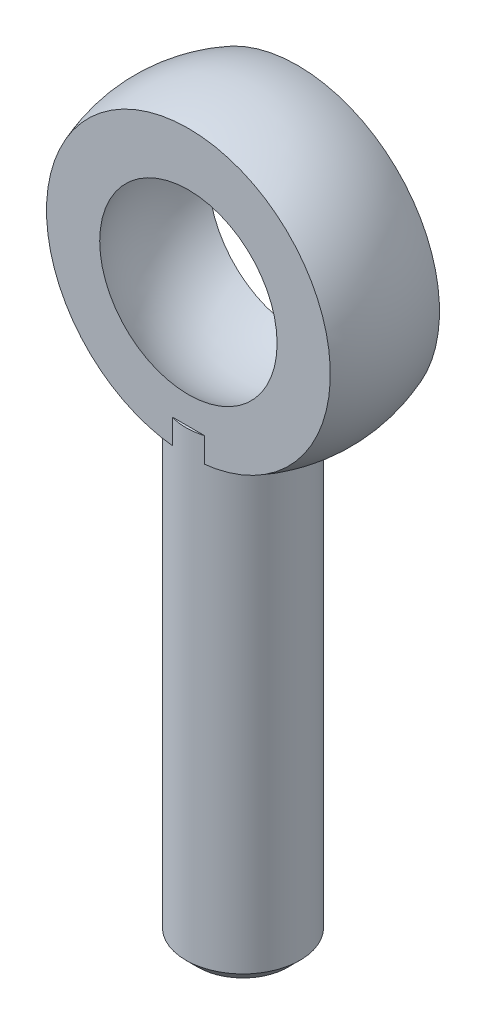
ISO-10303-21;
HEADER;
FILE_DESCRIPTION(('STEP AP214'),'2;1');
FILE_NAME('part.step','',(''),(''),'','','');
FILE_SCHEMA(('AUTOMOTIVE_DESIGN { 1 0 10303 214 1 1 1 1 }'));
ENDSEC;
DATA;
#1=APPLICATION_CONTEXT('core data for automotive mechanical design processes');
#2=APPLICATION_PROTOCOL_DEFINITION('international standard','automotive_design',2000,#1);
#3=PRODUCT_CONTEXT('',#1,'mechanical');
#4=PRODUCT('Part','Part','',(#3));
#5=PRODUCT_RELATED_PRODUCT_CATEGORY('part','',(#4));
#6=PRODUCT_DEFINITION_FORMATION('','',#4);
#7=PRODUCT_DEFINITION_CONTEXT('part definition',#1,'design');
#8=PRODUCT_DEFINITION('design','',#6,#7);
#9=PRODUCT_DEFINITION_SHAPE('','',#8);
#10=(LENGTH_UNIT() NAMED_UNIT(*) SI_UNIT(.MILLI.,.METRE.));
#11=(NAMED_UNIT(*) PLANE_ANGLE_UNIT() SI_UNIT($,.RADIAN.));
#12=(NAMED_UNIT(*) SI_UNIT($,.STERADIAN.) SOLID_ANGLE_UNIT());
#13=UNCERTAINTY_MEASURE_WITH_UNIT(LENGTH_MEASURE(1.E-05),#10,'distance_accuracy_value','');
#14=(GEOMETRIC_REPRESENTATION_CONTEXT(3) GLOBAL_UNCERTAINTY_ASSIGNED_CONTEXT((#13)) GLOBAL_UNIT_ASSIGNED_CONTEXT((#10,
#11,#12)) REPRESENTATION_CONTEXT('',''));
#15=CARTESIAN_POINT('',(0.,0.,0.));
#16=DIRECTION('',(0.,0.,1.));
#17=DIRECTION('',(1.,0.,0.));
#18=AXIS2_PLACEMENT_3D('',#15,#16,#17);
#19=CARTESIAN_POINT('',(-4.44089209850063E-13,-9.69999999999993,1.66533453693773E-13));
#20=DIRECTION('',(0.,-1.,0.));
#21=DIRECTION('',(0.,0.,-0.999999999999999));
#22=AXIS2_PLACEMENT_3D('',#19,#20,#21);
#23=CYLINDRICAL_SURFACE('',#22,4.7625);
#24=CARTESIAN_POINT('',(-4.44089209850063E-13,-48.2299999999999,1.66533453693773E-13));
#25=DIRECTION('',(0.,1.,0.));
#26=DIRECTION('',(0.,0.,0.999999999999999));
#27=AXIS2_PLACEMENT_3D('',#24,#25,#26);
#28=CIRCLE('',#27,4.7625);
#29=CARTESIAN_POINT('',(-4.44320535225584E-13,-48.2299999999999,4.76250000000016));
#30=VERTEX_POINT('',#29);
#31=EDGE_CURVE('E56',#30,#30,#28,.T.);
#32=ORIENTED_EDGE('',*,*,#31,.T.);
#33=EDGE_LOOP('',(#32));
#34=FACE_BOUND('',#33,.T.);
#35=CARTESIAN_POINT('',(-4.44089209850063E-13,-9.69999999999993,1.66533453693773E-13));
#36=DIRECTION('',(0.,1.,0.));
#37=DIRECTION('',(0.,0.,0.999999999999999));
#38=AXIS2_PLACEMENT_3D('',#35,#36,#37);
#39=CIRCLE('',#38,4.7625);
#40=CARTESIAN_POINT('',(-4.44320535225584E-13,-9.69999999999993,4.76250000000016));
#41=VERTEX_POINT('',#40);
#42=EDGE_CURVE('E60',#41,#41,#39,.T.);
#43=ORIENTED_EDGE('',*,*,#42,.F.);
#44=EDGE_LOOP('',(#43));
#45=FACE_BOUND('',#44,.T.);
#46=ADVANCED_FACE('F49',(#34,#45),#23,.T.);
#47=CARTESIAN_POINT('',(-4.44089209850063E-13,-9.69999999999993,1.66533453693773E-13));
#48=DIRECTION('',(0.,1.,0.));
#49=DIRECTION('',(0.,0.,0.999999999999999));
#50=AXIS2_PLACEMENT_3D('',#47,#48,#49);
#51=PLANE('',#50);
#52=ORIENTED_EDGE('',*,*,#42,.T.);
#53=EDGE_LOOP('',(#52));
#54=FACE_BOUND('',#53,.T.);
#55=ADVANCED_FACE('F67',(#54),#51,.T.);
#56=CARTESIAN_POINT('',(0.,-49.2300000000001,1.38777878078145E-13));
#57=DIRECTION('',(0.,1.,0.));
#58=DIRECTION('',(0.,0.,0.999999999999999));
#59=AXIS2_PLACEMENT_3D('',#56,#57,#58);
#60=PLANE('',#59);
#61=CARTESIAN_POINT('',(0.,-49.2300000000001,1.38777878078145E-13));
#62=DIRECTION('',(0.,1.,0.));
#63=DIRECTION('',(0.,0.,0.999999999999999));
#64=AXIS2_PLACEMENT_3D('',#61,#62,#63);
#65=CIRCLE('',#64,3.76250000000001);
#66=CARTESIAN_POINT('',(0.,-49.2300000000001,3.76250000000014));
#67=VERTEX_POINT('',#66);
#68=EDGE_CURVE('E11',#67,#67,#65,.F.);
#69=ORIENTED_EDGE('',*,*,#68,.T.);
#70=EDGE_LOOP('',(#69));
#71=FACE_BOUND('',#70,.T.);
#72=ADVANCED_FACE('F73',(#71),#60,.F.);
#73=CARTESIAN_POINT('',(-4.44089209850063E-13,-48.2299999999999,1.66533453693773E-13));
#74=DIRECTION('',(0.,1.,0.));
#75=DIRECTION('',(0.,0.,0.999999999999999));
#76=AXIS2_PLACEMENT_3D('',#73,#74,#75);
#77=CONICAL_SURFACE('',#76,4.7625,0.78539816339745);
#78=ORIENTED_EDGE('',*,*,#68,.F.);
#79=EDGE_LOOP('',(#78));
#80=FACE_BOUND('',#79,.T.);
#81=ORIENTED_EDGE('',*,*,#31,.F.);
#82=EDGE_LOOP('',(#81));
#83=FACE_BOUND('',#82,.T.);
#84=ADVANCED_FACE('F51',(#80,#83),#77,.T.);
#85=CLOSED_SHELL('',(#46,#55,#72,#84));
#86=MANIFOLD_SOLID_BREP('B2',#85);
#87=CARTESIAN_POINT('',(8.88178419700125E-13,0.,-4.56000000000012));
#88=DIRECTION('',(0.,0.,0.999999999999999));
#89=DIRECTION('',(0.,-1.,0.));
#90=AXIS2_PLACEMENT_3D('',#87,#88,#89);
#91=PLANE('',#90);
#92=CARTESIAN_POINT('',(8.88178419700125E-13,0.,-4.56000000000012));
#93=DIRECTION('',(0.,0.,0.999999999999999));
#94=DIRECTION('',(0.,-1.,0.));
#95=AXIS2_PLACEMENT_3D('',#92,#93,#94);
#96=CIRCLE('',#95,11.8531177333223);
#97=CARTESIAN_POINT('',(8.86862459278012E-13,-11.8531177333223,-4.56000000000012));
#98=VERTEX_POINT('',#97);
#99=EDGE_CURVE('E48',#98,#98,#96,.T.);
#100=ORIENTED_EDGE('',*,*,#99,.F.);
#101=EDGE_LOOP('',(#100));
#102=FACE_BOUND('',#101,.T.);
#103=CARTESIAN_POINT('',(8.88178419700125E-13,0.,-4.56000000000012));
#104=DIRECTION('',(0.,0.,0.999999999999999));
#105=DIRECTION('',(0.,-1.,0.));
#106=AXIS2_PLACEMENT_3D('',#103,#104,#105);
#107=CIRCLE('',#106,7.40921048425539);
#108=CARTESIAN_POINT('',(8.87355832092734E-13,-7.4092104842554,-4.56000000000012));
#109=VERTEX_POINT('',#108);
#110=EDGE_CURVE('E149',#109,#109,#107,.F.);
#111=ORIENTED_EDGE('',*,*,#110,.F.);
#112=EDGE_LOOP('',(#111));
#113=FACE_BOUND('',#112,.T.);
#114=ADVANCED_FACE('F137',(#102,#113),#91,.F.);
#115=CARTESIAN_POINT('',(4.44089209850063E-13,11.8531177333223,4.56000000000006));
#116=DIRECTION('',(0.,0.,-0.999999999999999));
#117=DIRECTION('',(0.,1.,0.));
#118=AXIS2_PLACEMENT_3D('',#115,#116,#117);
#119=PLANE('',#118);
#120=CARTESIAN_POINT('',(-8.88178419700125E-13,0.,4.56000000000012));
#121=DIRECTION('',(0.,0.,0.999999999999999));
#122=DIRECTION('',(0.,-1.,0.));
#123=AXIS2_PLACEMENT_3D('',#120,#121,#122);
#124=CIRCLE('',#123,11.8531177333223);
#125=CARTESIAN_POINT('',(-8.89494380122238E-13,-11.8531177333223,4.56000000000012));
#126=VERTEX_POINT('',#125);
#127=EDGE_CURVE('E145',#126,#126,#124,.T.);
#128=ORIENTED_EDGE('',*,*,#127,.T.);
#129=EDGE_LOOP('',(#128));
#130=FACE_BOUND('',#129,.T.);
#131=CARTESIAN_POINT('',(-8.88178419700125E-13,0.,4.56000000000012));
#132=DIRECTION('',(0.,0.,-0.999999999999999));
#133=DIRECTION('',(0.,1.,0.));
#134=AXIS2_PLACEMENT_3D('',#131,#132,#133);
#135=CIRCLE('',#134,7.40921048425539);
#136=CARTESIAN_POINT('',(-8.87355832092734E-13,7.4092104842554,4.56000000000012));
#137=VERTEX_POINT('',#136);
#138=EDGE_CURVE('E141',#137,#137,#135,.F.);
#139=ORIENTED_EDGE('',*,*,#138,.F.);
#140=EDGE_LOOP('',(#139));
#141=FACE_BOUND('',#140,.T.);
#142=ADVANCED_FACE('F160',(#130,#141),#119,.F.);
#143=CARTESIAN_POINT('',(0.,0.,0.));
#144=DIRECTION('',(0.,0.,0.999999999999999));
#145=DIRECTION('',(0.,1.,0.));
#146=AXIS2_PLACEMENT_3D('',#143,#144,#145);
#147=SPHERICAL_SURFACE('',#146,12.7);
#148=ORIENTED_EDGE('',*,*,#127,.F.);
#149=EDGE_LOOP('',(#148));
#150=FACE_BOUND('',#149,.T.);
#151=ORIENTED_EDGE('',*,*,#99,.T.);
#152=EDGE_LOOP('',(#151));
#153=FACE_BOUND('',#152,.T.);
#154=ADVANCED_FACE('F139',(#150,#153),#147,.T.);
#155=CARTESIAN_POINT('',(0.,0.,0.));
#156=DIRECTION('',(0.,1.,0.));
#157=DIRECTION('',(0.,0.,-0.999999999999999));
#158=AXIS2_PLACEMENT_3D('',#155,#156,#157);
#159=SPHERICAL_SURFACE('',#158,8.7);
#160=CARTESIAN_POINT('',(0.,0.,0.));
#161=DIRECTION('',(0.,0.,-1.));
#162=DIRECTION('',(0.,1.,0.));
#163=AXIS2_PLACEMENT_3D('',#160,#161,#162);
#164=SPHERICAL_SURFACE('',#163,8.7);
#165=ORIENTED_EDGE('',*,*,#138,.T.);
#166=EDGE_LOOP('',(#165));
#167=FACE_BOUND('',#166,.T.);
#168=ORIENTED_EDGE('',*,*,#110,.T.);
#169=EDGE_LOOP('',(#168));
#170=FACE_BOUND('',#169,.T.);
#171=ADVANCED_FACE('F158',(#167,#170),#164,.F.);
#172=CLOSED_SHELL('',(#114,#142,#154,#171));
#173=MANIFOLD_SOLID_BREP('B6',#172);
#174=ADVANCED_BREP_SHAPE_REPRESENTATION('',(#18,#86,#173),#14);
#175=SHAPE_DEFINITION_REPRESENTATION(#9,#174);
ENDSEC;
END-ISO-10303-21;
